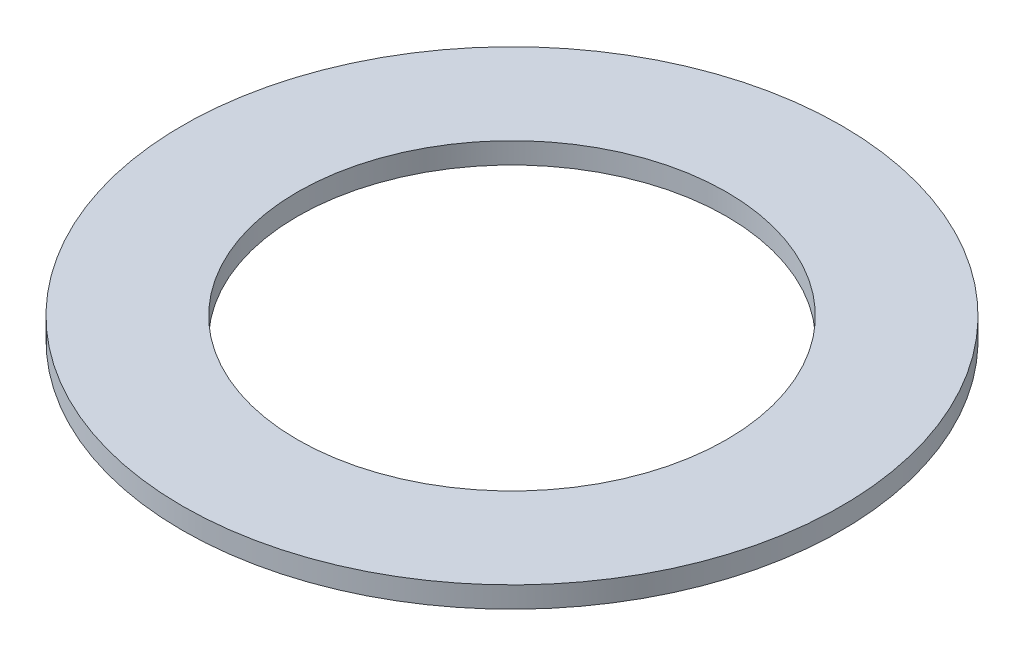
ISO-10303-21;
HEADER;
FILE_DESCRIPTION(('STEP AP214'),'2;1');
FILE_NAME('part.step','',(''),(''),'','','');
FILE_SCHEMA(('AUTOMOTIVE_DESIGN { 1 0 10303 214 1 1 1 1 }'));
ENDSEC;
DATA;
#1=APPLICATION_CONTEXT('core data for automotive mechanical design processes');
#2=APPLICATION_PROTOCOL_DEFINITION('international standard','automotive_design',2000,#1);
#3=PRODUCT_CONTEXT('',#1,'mechanical');
#4=PRODUCT('Part','Part','',(#3));
#5=PRODUCT_RELATED_PRODUCT_CATEGORY('part','',(#4));
#6=PRODUCT_DEFINITION_FORMATION('','',#4);
#7=PRODUCT_DEFINITION_CONTEXT('part definition',#1,'design');
#8=PRODUCT_DEFINITION('design','',#6,#7);
#9=PRODUCT_DEFINITION_SHAPE('','',#8);
#10=(LENGTH_UNIT() NAMED_UNIT(*) SI_UNIT(.MILLI.,.METRE.));
#11=(NAMED_UNIT(*) PLANE_ANGLE_UNIT() SI_UNIT($,.RADIAN.));
#12=(NAMED_UNIT(*) SI_UNIT($,.STERADIAN.) SOLID_ANGLE_UNIT());
#13=UNCERTAINTY_MEASURE_WITH_UNIT(LENGTH_MEASURE(1.E-05),#10,'distance_accuracy_value','');
#14=(GEOMETRIC_REPRESENTATION_CONTEXT(3) GLOBAL_UNCERTAINTY_ASSIGNED_CONTEXT((#13)) GLOBAL_UNIT_ASSIGNED_CONTEXT((#10,
#11,#12)) REPRESENTATION_CONTEXT('',''));
#15=CARTESIAN_POINT('',(0.,0.,0.));
#16=DIRECTION('',(0.,0.,1.));
#17=DIRECTION('',(1.,0.,0.));
#18=AXIS2_PLACEMENT_3D('',#15,#16,#17);
#19=CARTESIAN_POINT('',(0.,0.,0.));
#20=DIRECTION('',(0.,1.,0.));
#21=DIRECTION('',(0.,0.,1.));
#22=AXIS2_PLACEMENT_3D('',#19,#20,#21);
#23=CYLINDRICAL_SURFACE('',#22,8.2677);
#24=CARTESIAN_POINT('',(0.,0.8128,0.));
#25=DIRECTION('',(0.,1.,0.));
#26=DIRECTION('',(0.,0.,1.));
#27=AXIS2_PLACEMENT_3D('',#24,#25,#26);
#28=CIRCLE('',#27,8.2677);
#29=CARTESIAN_POINT('',(0.,0.8128,8.2677));
#30=VERTEX_POINT('',#29);
#31=EDGE_CURVE('E10',#30,#30,#28,.T.);
#32=ORIENTED_EDGE('',*,*,#31,.T.);
#33=EDGE_LOOP('',(#32));
#34=FACE_BOUND('',#33,.T.);
#35=CARTESIAN_POINT('',(0.,0.,0.));
#36=DIRECTION('',(0.,1.,0.));
#37=DIRECTION('',(0.,0.,1.));
#38=AXIS2_PLACEMENT_3D('',#35,#36,#37);
#39=CIRCLE('',#38,8.2677);
#40=CARTESIAN_POINT('',(0.,0.,8.2677));
#41=VERTEX_POINT('',#40);
#42=EDGE_CURVE('E44',#41,#41,#39,.T.);
#43=ORIENTED_EDGE('',*,*,#42,.F.);
#44=EDGE_LOOP('',(#43));
#45=FACE_BOUND('',#44,.T.);
#46=ADVANCED_FACE('F30',(#34,#45),#23,.F.);
#47=CARTESIAN_POINT('',(8.2677,0.8128,0.));
#48=DIRECTION('',(0.,1.,0.));
#49=DIRECTION('',(0.,0.,1.));
#50=AXIS2_PLACEMENT_3D('',#47,#48,#49);
#51=PLANE('',#50);
#52=CARTESIAN_POINT('',(0.,0.8128,0.));
#53=DIRECTION('',(0.,1.,0.));
#54=DIRECTION('',(0.,0.,1.));
#55=AXIS2_PLACEMENT_3D('',#52,#53,#54);
#56=CIRCLE('',#55,12.7);
#57=CARTESIAN_POINT('',(0.,0.8128,12.7));
#58=VERTEX_POINT('',#57);
#59=EDGE_CURVE('E36',#58,#58,#56,.T.);
#60=ORIENTED_EDGE('',*,*,#59,.T.);
#61=EDGE_LOOP('',(#60));
#62=FACE_BOUND('',#61,.T.);
#63=ORIENTED_EDGE('',*,*,#31,.F.);
#64=EDGE_LOOP('',(#63));
#65=FACE_BOUND('',#64,.T.);
#66=ADVANCED_FACE('F54',(#62,#65),#51,.T.);
#67=CARTESIAN_POINT('',(0.,0.,0.));
#68=DIRECTION('',(0.,1.,0.));
#69=DIRECTION('',(0.,0.,1.));
#70=AXIS2_PLACEMENT_3D('',#67,#68,#69);
#71=CYLINDRICAL_SURFACE('',#70,12.7);
#72=CARTESIAN_POINT('',(0.,0.,0.));
#73=DIRECTION('',(0.,1.,0.));
#74=DIRECTION('',(0.,0.,1.));
#75=AXIS2_PLACEMENT_3D('',#72,#73,#74);
#76=CIRCLE('',#75,12.7);
#77=CARTESIAN_POINT('',(0.,0.,12.7));
#78=VERTEX_POINT('',#77);
#79=EDGE_CURVE('E40',#78,#78,#76,.T.);
#80=ORIENTED_EDGE('',*,*,#79,.T.);
#81=EDGE_LOOP('',(#80));
#82=FACE_BOUND('',#81,.T.);
#83=ORIENTED_EDGE('',*,*,#59,.F.);
#84=EDGE_LOOP('',(#83));
#85=FACE_BOUND('',#84,.T.);
#86=ADVANCED_FACE('F58',(#82,#85),#71,.T.);
#87=CARTESIAN_POINT('',(12.7,0.,0.));
#88=DIRECTION('',(0.,-1.,0.));
#89=DIRECTION('',(0.,0.,-1.));
#90=AXIS2_PLACEMENT_3D('',#87,#88,#89);
#91=PLANE('',#90);
#92=ORIENTED_EDGE('',*,*,#42,.T.);
#93=EDGE_LOOP('',(#92));
#94=FACE_BOUND('',#93,.T.);
#95=ORIENTED_EDGE('',*,*,#79,.F.);
#96=EDGE_LOOP('',(#95));
#97=FACE_BOUND('',#96,.T.);
#98=ADVANCED_FACE('F50',(#94,#97),#91,.T.);
#99=CLOSED_SHELL('',(#46,#66,#86,#98));
#100=MANIFOLD_SOLID_BREP('B2',#99);
#101=ADVANCED_BREP_SHAPE_REPRESENTATION('',(#18,#100),#14);
#102=SHAPE_DEFINITION_REPRESENTATION(#9,#101);
ENDSEC;
END-ISO-10303-21;
